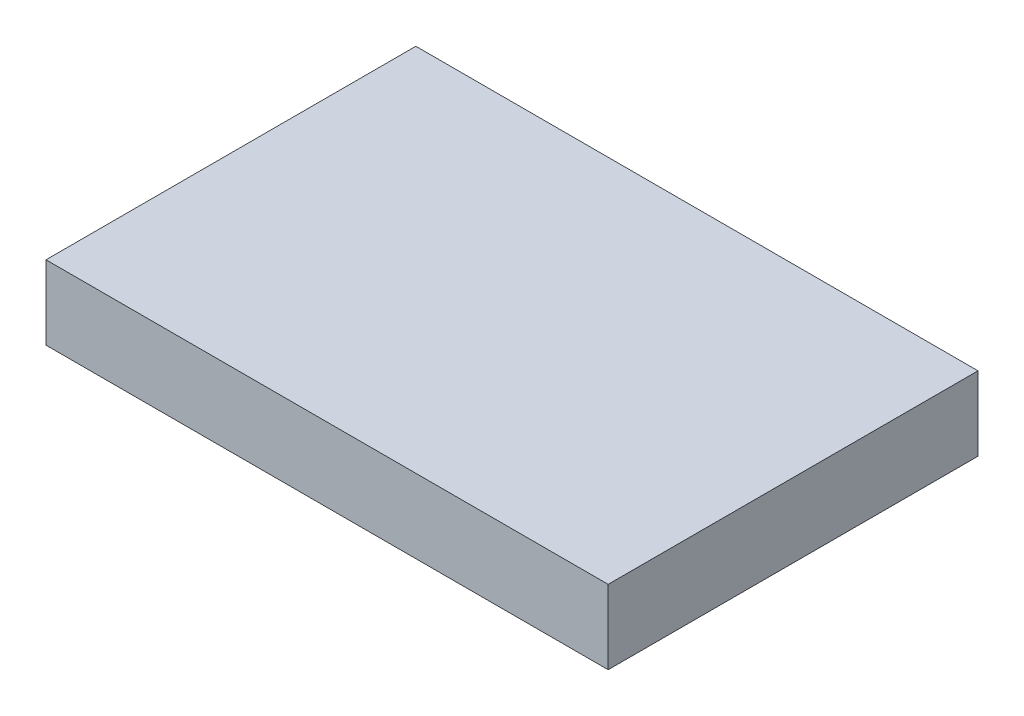
ISO-10303-21;
HEADER;
FILE_DESCRIPTION(('STEP AP214'),'2;1');
FILE_NAME('part.step','',(''),(''),'','','');
FILE_SCHEMA(('AUTOMOTIVE_DESIGN { 1 0 10303 214 1 1 1 1 }'));
ENDSEC;
DATA;
#1=APPLICATION_CONTEXT('core data for automotive mechanical design processes');
#2=APPLICATION_PROTOCOL_DEFINITION('international standard','automotive_design',2000,#1);
#3=PRODUCT_CONTEXT('',#1,'mechanical');
#4=PRODUCT('Part','Part','',(#3));
#5=PRODUCT_RELATED_PRODUCT_CATEGORY('part','',(#4));
#6=PRODUCT_DEFINITION_FORMATION('','',#4);
#7=PRODUCT_DEFINITION_CONTEXT('part definition',#1,'design');
#8=PRODUCT_DEFINITION('design','',#6,#7);
#9=PRODUCT_DEFINITION_SHAPE('','',#8);
#10=(LENGTH_UNIT() NAMED_UNIT(*) SI_UNIT(.MILLI.,.METRE.));
#11=(NAMED_UNIT(*) PLANE_ANGLE_UNIT() SI_UNIT($,.RADIAN.));
#12=(NAMED_UNIT(*) SI_UNIT($,.STERADIAN.) SOLID_ANGLE_UNIT());
#13=UNCERTAINTY_MEASURE_WITH_UNIT(LENGTH_MEASURE(1.E-05),#10,'distance_accuracy_value','');
#14=(GEOMETRIC_REPRESENTATION_CONTEXT(3) GLOBAL_UNCERTAINTY_ASSIGNED_CONTEXT((#13)) GLOBAL_UNIT_ASSIGNED_CONTEXT((#10,
#11,#12)) REPRESENTATION_CONTEXT('',''));
#15=CARTESIAN_POINT('',(0.,0.,0.));
#16=DIRECTION('',(0.,0.,1.));
#17=DIRECTION('',(1.,0.,0.));
#18=AXIS2_PLACEMENT_3D('',#15,#16,#17);
#19=CARTESIAN_POINT('',(0.,5.,0.));
#20=DIRECTION('',(1.,0.,0.));
#21=DIRECTION('',(0.,0.,-1.));
#22=AXIS2_PLACEMENT_3D('',#19,#20,#21);
#23=PLANE('',#22);
#24=DIRECTION('',(0.,0.,1.));
#25=VECTOR('',#24,1.);
#26=CARTESIAN_POINT('',(0.,0.,0.));
#27=LINE('',#26,#25);
#28=CARTESIAN_POINT('',(0.,0.,-25.));
#29=VERTEX_POINT('',#28);
#30=CARTESIAN_POINT('',(0.,0.,0.));
#31=VERTEX_POINT('',#30);
#32=EDGE_CURVE('E100',#29,#31,#27,.T.);
#33=ORIENTED_EDGE('',*,*,#32,.T.);
#34=DIRECTION('',(0.,-1.,0.));
#35=VECTOR('',#34,1.);
#36=CARTESIAN_POINT('',(0.,5.,0.));
#37=LINE('',#36,#35);
#38=CARTESIAN_POINT('',(0.,5.,0.));
#39=VERTEX_POINT('',#38);
#40=EDGE_CURVE('E11',#39,#31,#37,.T.);
#41=ORIENTED_EDGE('',*,*,#40,.F.);
#42=DIRECTION('',(0.,0.,1.));
#43=VECTOR('',#42,1.);
#44=CARTESIAN_POINT('',(0.,5.,0.));
#45=LINE('',#44,#43);
#46=CARTESIAN_POINT('',(0.,5.,-25.));
#47=VERTEX_POINT('',#46);
#48=EDGE_CURVE('E88',#47,#39,#45,.T.);
#49=ORIENTED_EDGE('',*,*,#48,.F.);
#50=DIRECTION('',(0.,-1.,0.));
#51=VECTOR('',#50,1.);
#52=CARTESIAN_POINT('',(0.,5.,-25.));
#53=LINE('',#52,#51);
#54=EDGE_CURVE('E96',#47,#29,#53,.T.);
#55=ORIENTED_EDGE('',*,*,#54,.T.);
#56=EDGE_LOOP('',(#33,#41,#49,#55));
#57=FACE_BOUND('',#56,.T.);
#58=ADVANCED_FACE('F37',(#57),#23,.F.);
#59=CARTESIAN_POINT('',(0.,5.,0.));
#60=DIRECTION('',(0.,0.,-1.));
#61=DIRECTION('',(-1.,0.,0.));
#62=AXIS2_PLACEMENT_3D('',#59,#60,#61);
#63=PLANE('',#62);
#64=DIRECTION('',(1.,0.,0.));
#65=VECTOR('',#64,1.);
#66=CARTESIAN_POINT('',(0.,0.,0.));
#67=LINE('',#66,#65);
#68=CARTESIAN_POINT('',(38.,0.,0.));
#69=VERTEX_POINT('',#68);
#70=EDGE_CURVE('E92',#31,#69,#67,.T.);
#71=ORIENTED_EDGE('',*,*,#70,.T.);
#72=DIRECTION('',(0.,-1.,0.));
#73=VECTOR('',#72,1.);
#74=CARTESIAN_POINT('',(38.,5.,0.));
#75=LINE('',#74,#73);
#76=CARTESIAN_POINT('',(38.,5.,0.));
#77=VERTEX_POINT('',#76);
#78=EDGE_CURVE('E45',#77,#69,#75,.T.);
#79=ORIENTED_EDGE('',*,*,#78,.F.);
#80=DIRECTION('',(1.,0.,0.));
#81=VECTOR('',#80,1.);
#82=CARTESIAN_POINT('',(0.,5.,0.));
#83=LINE('',#82,#81);
#84=EDGE_CURVE('E83',#39,#77,#83,.T.);
#85=ORIENTED_EDGE('',*,*,#84,.F.);
#86=ORIENTED_EDGE('',*,*,#40,.T.);
#87=EDGE_LOOP('',(#71,#79,#85,#86));
#88=FACE_BOUND('',#87,.T.);
#89=ADVANCED_FACE('F91',(#88),#63,.F.);
#90=CARTESIAN_POINT('',(38.,5.,0.));
#91=DIRECTION('',(-1.,0.,0.));
#92=DIRECTION('',(0.,0.,1.));
#93=AXIS2_PLACEMENT_3D('',#90,#91,#92);
#94=PLANE('',#93);
#95=DIRECTION('',(0.,0.,-1.));
#96=VECTOR('',#95,1.);
#97=CARTESIAN_POINT('',(38.,0.,0.));
#98=LINE('',#97,#96);
#99=CARTESIAN_POINT('',(38.,0.,-25.));
#100=VERTEX_POINT('',#99);
#101=EDGE_CURVE('E70',#69,#100,#98,.T.);
#102=ORIENTED_EDGE('',*,*,#101,.T.);
#103=DIRECTION('',(0.,-1.,0.));
#104=VECTOR('',#103,1.);
#105=CARTESIAN_POINT('',(38.,5.,-25.));
#106=LINE('',#105,#104);
#107=CARTESIAN_POINT('',(38.,5.,-25.));
#108=VERTEX_POINT('',#107);
#109=EDGE_CURVE('E93',#108,#100,#106,.T.);
#110=ORIENTED_EDGE('',*,*,#109,.F.);
#111=DIRECTION('',(0.,0.,-1.));
#112=VECTOR('',#111,1.);
#113=CARTESIAN_POINT('',(38.,5.,0.));
#114=LINE('',#113,#112);
#115=EDGE_CURVE('E86',#77,#108,#114,.T.);
#116=ORIENTED_EDGE('',*,*,#115,.F.);
#117=ORIENTED_EDGE('',*,*,#78,.T.);
#118=EDGE_LOOP('',(#102,#110,#116,#117));
#119=FACE_BOUND('',#118,.T.);
#120=ADVANCED_FACE('F94',(#119),#94,.F.);
#121=CARTESIAN_POINT('',(0.,5.,-25.));
#122=DIRECTION('',(0.,0.,1.));
#123=DIRECTION('',(1.,0.,0.));
#124=AXIS2_PLACEMENT_3D('',#121,#122,#123);
#125=PLANE('',#124);
#126=DIRECTION('',(-1.,0.,0.));
#127=VECTOR('',#126,1.);
#128=CARTESIAN_POINT('',(0.,0.,-25.));
#129=LINE('',#128,#127);
#130=EDGE_CURVE('E76',#100,#29,#129,.T.);
#131=ORIENTED_EDGE('',*,*,#130,.T.);
#132=ORIENTED_EDGE('',*,*,#54,.F.);
#133=DIRECTION('',(-1.,0.,0.));
#134=VECTOR('',#133,1.);
#135=CARTESIAN_POINT('',(0.,5.,-25.));
#136=LINE('',#135,#134);
#137=EDGE_CURVE('E53',#108,#47,#136,.T.);
#138=ORIENTED_EDGE('',*,*,#137,.F.);
#139=ORIENTED_EDGE('',*,*,#109,.T.);
#140=EDGE_LOOP('',(#131,#132,#138,#139));
#141=FACE_BOUND('',#140,.T.);
#142=ADVANCED_FACE('F107',(#141),#125,.F.);
#143=CARTESIAN_POINT('',(0.,5.,0.));
#144=DIRECTION('',(0.,-1.,0.));
#145=DIRECTION('',(0.,0.,-1.));
#146=AXIS2_PLACEMENT_3D('',#143,#144,#145);
#147=PLANE('',#146);
#148=ORIENTED_EDGE('',*,*,#48,.T.);
#149=ORIENTED_EDGE('',*,*,#84,.T.);
#150=ORIENTED_EDGE('',*,*,#115,.T.);
#151=ORIENTED_EDGE('',*,*,#137,.T.);
#152=EDGE_LOOP('',(#148,#149,#150,#151));
#153=FACE_BOUND('',#152,.T.);
#154=ADVANCED_FACE('F84',(#153),#147,.F.);
#155=CARTESIAN_POINT('',(0.,0.,0.));
#156=DIRECTION('',(0.,-1.,0.));
#157=DIRECTION('',(0.,0.,-1.));
#158=AXIS2_PLACEMENT_3D('',#155,#156,#157);
#159=PLANE('',#158);
#160=ORIENTED_EDGE('',*,*,#32,.F.);
#161=ORIENTED_EDGE('',*,*,#130,.F.);
#162=ORIENTED_EDGE('',*,*,#101,.F.);
#163=ORIENTED_EDGE('',*,*,#70,.F.);
#164=EDGE_LOOP('',(#160,#161,#162,#163));
#165=FACE_BOUND('',#164,.T.);
#166=ADVANCED_FACE('F110',(#165),#159,.T.);
#167=CLOSED_SHELL('',(#58,#89,#120,#142,#154,#166));
#168=MANIFOLD_SOLID_BREP('B2',#167);
#169=ADVANCED_BREP_SHAPE_REPRESENTATION('',(#18,#168),#14);
#170=SHAPE_DEFINITION_REPRESENTATION(#9,#169);
ENDSEC;
END-ISO-10303-21;
